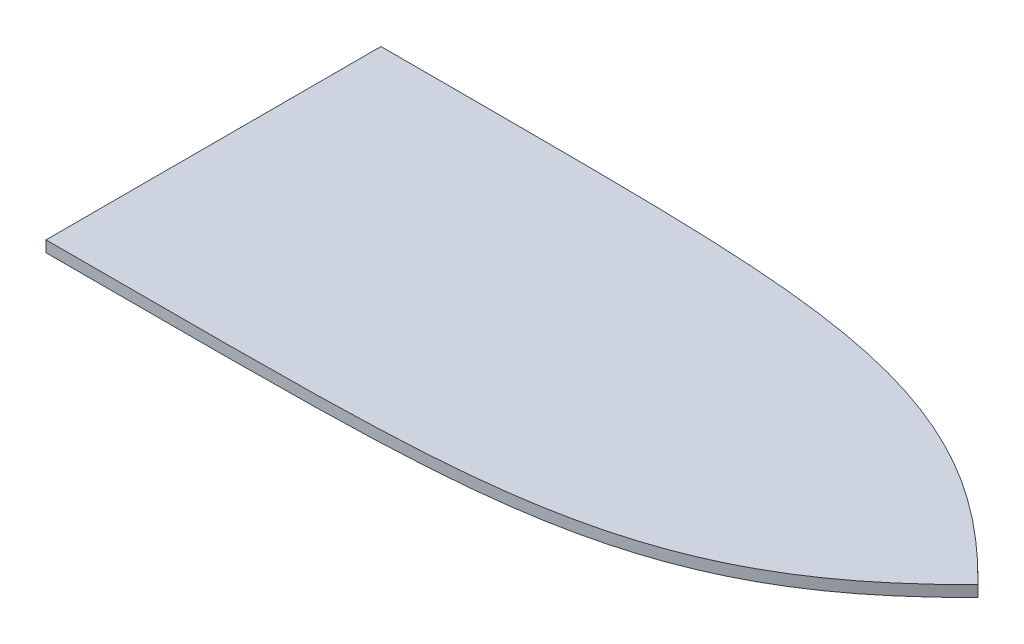
ISO-10303-21;
HEADER;
FILE_DESCRIPTION(('STEP AP214'),'2;1');
FILE_NAME('part.step','',(''),(''),'','','');
FILE_SCHEMA(('AUTOMOTIVE_DESIGN { 1 0 10303 214 1 1 1 1 }'));
ENDSEC;
DATA;
#1=APPLICATION_CONTEXT('core data for automotive mechanical design processes');
#2=APPLICATION_PROTOCOL_DEFINITION('international standard','automotive_design',2000,#1);
#3=PRODUCT_CONTEXT('',#1,'mechanical');
#4=PRODUCT('Part','Part','',(#3));
#5=PRODUCT_RELATED_PRODUCT_CATEGORY('part','',(#4));
#6=PRODUCT_DEFINITION_FORMATION('','',#4);
#7=PRODUCT_DEFINITION_CONTEXT('part definition',#1,'design');
#8=PRODUCT_DEFINITION('design','',#6,#7);
#9=PRODUCT_DEFINITION_SHAPE('','',#8);
#10=(LENGTH_UNIT() NAMED_UNIT(*) SI_UNIT(.MILLI.,.METRE.));
#11=(NAMED_UNIT(*) PLANE_ANGLE_UNIT() SI_UNIT($,.RADIAN.));
#12=(NAMED_UNIT(*) SI_UNIT($,.STERADIAN.) SOLID_ANGLE_UNIT());
#13=UNCERTAINTY_MEASURE_WITH_UNIT(LENGTH_MEASURE(1.E-05),#10,'distance_accuracy_value','');
#14=(GEOMETRIC_REPRESENTATION_CONTEXT(3) GLOBAL_UNCERTAINTY_ASSIGNED_CONTEXT((#13)) GLOBAL_UNIT_ASSIGNED_CONTEXT((#10,
#11,#12)) REPRESENTATION_CONTEXT('',''));
#15=CARTESIAN_POINT('',(0.,0.,0.));
#16=DIRECTION('',(0.,0.,1.));
#17=DIRECTION('',(1.,0.,0.));
#18=AXIS2_PLACEMENT_3D('',#15,#16,#17);
#19=CARTESIAN_POINT('',(3126.38132717579,1126.49564461762,190.290110191663));
#20=CARTESIAN_POINT('',(3145.55899842546,1126.49564461762,190.290110191663));
#21=CARTESIAN_POINT('',(3164.73667100085,1126.49564461762,190.290361376031));
#22=CARTESIAN_POINT('',(3203.0920051003,1126.49564461762,190.288769856083));
#23=CARTESIAN_POINT('',(3222.26966809878,1126.49564461762,190.28720650738));
#24=CARTESIAN_POINT('',(3260.6249139643,1126.49564461762,190.268897357972));
#25=CARTESIAN_POINT('',(3279.80249832739,1126.49564461762,190.252435010212));
#26=CARTESIAN_POINT('',(3318.15741505144,1126.49564461762,190.171763624873));
#27=CARTESIAN_POINT('',(3337.33474896159,1126.49564461762,190.107848108966));
#28=CARTESIAN_POINT('',(3375.68884457487,1126.49564461762,189.871601358953));
#29=CARTESIAN_POINT('',(3394.86560792166,1126.49564461762,189.699581549423));
#30=CARTESIAN_POINT('',(3433.21804614632,1126.49564461762,189.149310376775));
#31=CARTESIAN_POINT('',(3452.39655038311,1126.49564461762,188.771308458225));
#32=CARTESIAN_POINT('',(3490.73803525502,1126.49564461762,187.664823704028));
#33=CARTESIAN_POINT('',(3509.89746429211,1126.49564461762,186.936761405439));
#34=CARTESIAN_POINT('',(3548.18075169245,1126.49564461762,184.930982148366));
#35=CARTESIAN_POINT('',(3567.30462912808,1126.49564461762,183.65355990525));
#36=CARTESIAN_POINT('',(3595.95095268833,1126.49564461762,181.127168551783));
#37=CARTESIAN_POINT('',(3605.49311059666,1126.49564461762,180.182795126516));
#38=CARTESIAN_POINT('',(3619.79449109195,1126.49564461762,178.583024866821));
#39=CARTESIAN_POINT('',(3624.56158117287,1126.49564461762,178.018949986125));
#40=CARTESIAN_POINT('',(3634.08223039328,1126.49564461762,176.825410574507));
#41=CARTESIAN_POINT('',(3638.83302976218,1126.49564461762,176.196315819789));
#42=CARTESIAN_POINT('',(3662.53581528294,1126.49564461762,172.877050276513));
#43=CARTESIAN_POINT('',(3681.33438224533,1126.49564461762,169.666233066305));
#44=CARTESIAN_POINT('',(3718.50803120523,1126.49564461762,161.807451621774));
#45=CARTESIAN_POINT('',(3736.88278069571,1126.49564461762,157.158358984965));
#46=CARTESIAN_POINT('',(3773.11172797938,1126.49564461762,146.093619088016));
#47=CARTESIAN_POINT('',(3790.96545795827,1126.49564461762,139.676384243934));
#48=CARTESIAN_POINT('',(3817.29142422314,1126.49564461762,128.507694941196));
#49=CARTESIAN_POINT('',(3825.99110795359,1126.49564461762,124.528110667027));
#50=CARTESIAN_POINT('',(3838.92101640911,1126.49564461762,118.152799142926));
#51=CARTESIAN_POINT('',(3843.21106522886,1126.49564461762,115.96009213403));
#52=CARTESIAN_POINT('',(3849.61564966226,1126.49564461762,112.567564233644));
#53=CARTESIAN_POINT('',(3851.74737870301,1126.49564461762,111.418399334887));
#54=CARTESIAN_POINT('',(3855.9885348718,1126.49564461762,109.09196681709));
#55=CARTESIAN_POINT('',(3858.09815000584,1126.49564461762,107.914646677153));
#56=CARTESIAN_POINT('',(3868.59192520059,1126.49564461762,101.958188190843));
#57=CARTESIAN_POINT('',(3876.8129489964,1126.49564461762,96.9691743638711));
#58=CARTESIAN_POINT('',(3892.92396640865,1126.49564461762,86.5652750128258));
#59=CARTESIAN_POINT('',(3900.81396392045,1126.49564461762,81.1503945001743));
#60=CARTESIAN_POINT('',(3916.28581346307,1126.49564461762,69.9242030370405));
#61=CARTESIAN_POINT('',(3923.86765586817,1126.49564461762,64.1128797030446));
#62=CARTESIAN_POINT('',(3938.75204040131,1126.49564461762,52.1309120715934));
#63=CARTESIAN_POINT('',(3946.05455161555,1126.49564461762,45.9602280033876));
#64=CARTESIAN_POINT('',(3960.41565430139,1126.49564461762,33.3050561076343));
#65=CARTESIAN_POINT('',(3967.47418175314,1126.49564461762,26.8204859182691));
#66=CARTESIAN_POINT('',(3981.39060421351,1126.49564461762,13.5932310703164));
#67=CARTESIAN_POINT('',(3988.24838146846,1126.49564461762,6.85039492114141));
#68=CARTESIAN_POINT('',(3995.03275574722,1126.49564461762,0.0131255390144778));
#69=B_SPLINE_CURVE_WITH_KNOTS('',3,(#19,#20,#21,#22,#23,#24,#25,#26,#27,#28,#29,#30,#31,#32,#33,
#34,#35,#36,#37,#38,#39,#40,#41,#42,#43,#44,#45,#46,#47,#48,#49,#50,#51,#52,#53,#54,#55,#56,#57,
#58,#59,#60,#61,#62,#63,#64,#65,#66,#67,#68),.UNSPECIFIED.,.F.,.F.,(4,2,2,2,2,2,2,2,2,2,2,2,2,2,
2,2,2,2,2,2,2,2,2,2,4),(0.,0.0624999999999999,0.125,0.1875,0.25,0.3125,0.375,0.437499999999999,
0.499999999999999,0.531249999999999,0.546874999999999,0.562499999999999,0.625000000000001,
0.687500000000002,0.750000000000003,0.781250000000004,0.796875000000004,0.804687500000004,
0.812500000000003,0.843750000000003,0.875000000000002,0.906250000000002,0.937500000000001,
0.96875,1.),.UNSPECIFIED.);
#70=DIRECTION('',(0.,-1.,0.));
#71=VECTOR('',#70,1.);
#72=SURFACE_OF_LINEAR_EXTRUSION('',#69,#71);
#73=CARTESIAN_POINT('',(3126.38132717579,1113.79564461762,190.290110191663));
#74=CARTESIAN_POINT('',(3145.55899842546,1113.79564461762,190.290110191663));
#75=CARTESIAN_POINT('',(3164.73667100085,1113.79564461762,190.290361376031));
#76=CARTESIAN_POINT('',(3203.0920051003,1113.79564461762,190.288769856083));
#77=CARTESIAN_POINT('',(3222.26966809878,1113.79564461762,190.28720650738));
#78=CARTESIAN_POINT('',(3260.6249139643,1113.79564461762,190.268897357972));
#79=CARTESIAN_POINT('',(3279.80249832739,1113.79564461762,190.252435010212));
#80=CARTESIAN_POINT('',(3318.15741505144,1113.79564461762,190.171763624873));
#81=CARTESIAN_POINT('',(3337.33474896159,1113.79564461762,190.107848108966));
#82=CARTESIAN_POINT('',(3375.68884457487,1113.79564461762,189.871601358953));
#83=CARTESIAN_POINT('',(3394.86560792166,1113.79564461762,189.699581549423));
#84=CARTESIAN_POINT('',(3433.21804614632,1113.79564461762,189.149310376775));
#85=CARTESIAN_POINT('',(3452.39655038311,1113.79564461762,188.771308458225));
#86=CARTESIAN_POINT('',(3490.73803525502,1113.79564461762,187.664823704028));
#87=CARTESIAN_POINT('',(3509.89746429211,1113.79564461762,186.936761405439));
#88=CARTESIAN_POINT('',(3548.18075169245,1113.79564461762,184.930982148366));
#89=CARTESIAN_POINT('',(3567.30462912808,1113.79564461762,183.65355990525));
#90=CARTESIAN_POINT('',(3595.95095268833,1113.79564461762,181.127168551783));
#91=CARTESIAN_POINT('',(3605.49311059666,1113.79564461762,180.182795126516));
#92=CARTESIAN_POINT('',(3619.79449109195,1113.79564461762,178.583024866821));
#93=CARTESIAN_POINT('',(3624.56158117287,1113.79564461762,178.018949986125));
#94=CARTESIAN_POINT('',(3634.08223039328,1113.79564461762,176.825410574507));
#95=CARTESIAN_POINT('',(3638.83302976218,1113.79564461762,176.196315819789));
#96=CARTESIAN_POINT('',(3662.53581528294,1113.79564461762,172.877050276513));
#97=CARTESIAN_POINT('',(3681.33438224533,1113.79564461762,169.666233066305));
#98=CARTESIAN_POINT('',(3718.50803120523,1113.79564461762,161.807451621774));
#99=CARTESIAN_POINT('',(3736.88278069571,1113.79564461762,157.158358984965));
#100=CARTESIAN_POINT('',(3773.11172797938,1113.79564461762,146.093619088016));
#101=CARTESIAN_POINT('',(3790.96545795827,1113.79564461762,139.676384243934));
#102=CARTESIAN_POINT('',(3817.29142422314,1113.79564461762,128.507694941196));
#103=CARTESIAN_POINT('',(3825.99110795359,1113.79564461762,124.528110667027));
#104=CARTESIAN_POINT('',(3838.92101640911,1113.79564461762,118.152799142926));
#105=CARTESIAN_POINT('',(3843.21106522886,1113.79564461762,115.96009213403));
#106=CARTESIAN_POINT('',(3849.61564966226,1113.79564461762,112.567564233644));
#107=CARTESIAN_POINT('',(3851.74737870301,1113.79564461762,111.418399334887));
#108=CARTESIAN_POINT('',(3855.9885348718,1113.79564461762,109.09196681709));
#109=CARTESIAN_POINT('',(3858.09815000584,1113.79564461762,107.914646677153));
#110=CARTESIAN_POINT('',(3868.59192520059,1113.79564461762,101.958188190843));
#111=CARTESIAN_POINT('',(3876.8129489964,1113.79564461762,96.9691743638711));
#112=CARTESIAN_POINT('',(3892.92396640865,1113.79564461762,86.5652750128258));
#113=CARTESIAN_POINT('',(3900.81396392045,1113.79564461762,81.1503945001743));
#114=CARTESIAN_POINT('',(3916.28581346307,1113.79564461762,69.9242030370405));
#115=CARTESIAN_POINT('',(3923.86765586817,1113.79564461762,64.1128797030446));
#116=CARTESIAN_POINT('',(3938.75204040131,1113.79564461762,52.1309120715934));
#117=CARTESIAN_POINT('',(3946.05455161555,1113.79564461762,45.9602280033876));
#118=CARTESIAN_POINT('',(3960.41565430139,1113.79564461762,33.3050561076343));
#119=CARTESIAN_POINT('',(3967.47418175314,1113.79564461762,26.8204859182691));
#120=CARTESIAN_POINT('',(3981.39060421351,1113.79564461762,13.5932310703164));
#121=CARTESIAN_POINT('',(3988.24838146846,1113.79564461762,6.85039492114141));
#122=CARTESIAN_POINT('',(3995.03275574722,1113.79564461762,0.0131255390144778));
#123=B_SPLINE_CURVE_WITH_KNOTS('',3,(#73,#74,#75,#76,#77,#78,#79,#80,#81,#82,#83,#84,#85,#86,
#87,#88,#89,#90,#91,#92,#93,#94,#95,#96,#97,#98,#99,#100,#101,#102,#103,#104,#105,#106,#107,
#108,#109,#110,#111,#112,#113,#114,#115,#116,#117,#118,#119,#120,#121,#122),.UNSPECIFIED.,.F.,
.F.,(4,2,2,2,2,2,2,2,2,2,2,2,2,2,2,2,2,2,2,2,2,2,2,2,4),(0.,0.0624999999999999,0.125,0.1875,
0.25,0.3125,0.375,0.437499999999999,0.499999999999999,0.531249999999999,0.546874999999999,
0.562499999999999,0.625000000000001,0.687500000000002,0.750000000000003,0.781250000000004,
0.796875000000004,0.804687500000004,0.812500000000003,0.843750000000003,0.875000000000002,
0.906250000000002,0.937500000000001,0.96875,1.),.UNSPECIFIED.);
#124=CARTESIAN_POINT('',(3126.38132717579,1113.79564461762,190.290110191663));
#125=VERTEX_POINT('',#124);
#126=CARTESIAN_POINT('',(3995.03275574722,1113.79564461762,0.0131255390155955));
#127=VERTEX_POINT('',#126);
#128=EDGE_CURVE('E90',#125,#127,#123,.T.);
#129=ORIENTED_EDGE('',*,*,#128,.T.);
#130=DIRECTION('',(0.,-1.,0.));
#131=VECTOR('',#130,1.);
#132=CARTESIAN_POINT('',(3995.03275574722,1126.49564461762,0.0131255390155955));
#133=LINE('',#132,#131);
#134=CARTESIAN_POINT('',(3995.03275574722,1126.49564461762,0.0131255390155955));
#135=VERTEX_POINT('',#134);
#136=EDGE_CURVE('E11',#135,#127,#133,.T.);
#137=ORIENTED_EDGE('',*,*,#136,.F.);
#138=CARTESIAN_POINT('',(3126.38132717579,1126.49564461762,190.290110191663));
#139=VERTEX_POINT('',#138);
#140=EDGE_CURVE('E84',#139,#135,#69,.T.);
#141=ORIENTED_EDGE('',*,*,#140,.F.);
#142=DIRECTION('',(0.,-1.,0.));
#143=VECTOR('',#142,1.);
#144=CARTESIAN_POINT('',(3126.38132717579,1126.49564461762,190.290110191663));
#145=LINE('',#144,#143);
#146=EDGE_CURVE('E91',#139,#125,#145,.T.);
#147=ORIENTED_EDGE('',*,*,#146,.T.);
#148=EDGE_LOOP('',(#129,#137,#141,#147));
#149=FACE_BOUND('',#148,.T.);
#150=ADVANCED_FACE('F43',(#149),#72,.F.);
#151=CARTESIAN_POINT('',(3995.03275574722,1126.49564461762,0.0131255390155955));
#152=CARTESIAN_POINT('',(3988.27400703092,1126.49564461762,-6.79831848820773));
#153=CARTESIAN_POINT('',(3981.44491199492,1126.49564461762,-13.5134848270649));
#154=CARTESIAN_POINT('',(3967.59492702722,1126.49564461762,-26.6813223340386));
#155=CARTESIAN_POINT('',(3960.57414978155,1126.49564461762,-33.1341477269943));
#156=CARTESIAN_POINT('',(3946.30047640637,1126.49564461762,-45.7221149487883));
#157=CARTESIAN_POINT('',(3939.04764289468,1126.49564461762,-51.8573424779146));
#158=CARTESIAN_POINT('',(3924.27740565611,1126.49564461762,-63.7657002886806));
#159=CARTESIAN_POINT('',(3916.76003391145,1126.49564461762,-69.5388743419838));
#160=CARTESIAN_POINT('',(3901.43478894199,1126.49564461762,-80.6876350396419));
#161=CARTESIAN_POINT('',(3893.62692838034,1126.49564461762,-86.0632390151013));
#162=CARTESIAN_POINT('',(3877.70066460651,1126.49564461762,-96.3894307226177));
#163=CARTESIAN_POINT('',(3869.58226219495,1126.49564461762,-101.340019550417));
#164=CARTESIAN_POINT('',(3853.02058877224,1126.49564461762,-110.796574119445));
#165=CARTESIAN_POINT('',(3844.57731239192,1126.49564461762,-115.302532512274));
#166=CARTESIAN_POINT('',(3831.66235577614,1126.49564461762,-121.71925646162));
#167=CARTESIAN_POINT('',(3827.31574254016,1126.49564461762,-123.801191763108));
#168=CARTESIAN_POINT('',(3818.5387572713,1126.49564461762,-127.850428034349));
#169=CARTESIAN_POINT('',(3814.12988083734,1126.49564461762,-129.807781740319));
#170=CARTESIAN_POINT('',(3792.00361957349,1126.49564461762,-139.260601754897));
#171=CARTESIAN_POINT('',(3774.02172415076,1126.49564461762,-145.760161330034));
#172=CARTESIAN_POINT('',(3737.57904788596,1126.49564461762,-156.947481092662));
#173=CARTESIAN_POINT('',(3719.11870565644,1126.49564461762,-161.636900712472));
#174=CARTESIAN_POINT('',(3681.81162256509,1126.49564461762,-169.553852040892));
#175=CARTESIAN_POINT('',(3662.96517207717,1126.49564461762,-172.782482340553));
#176=CARTESIAN_POINT('',(3639.2218984145,1126.49564461762,-176.117550684878));
#177=CARTESIAN_POINT('',(3634.46396688847,1126.49564461762,-176.749466837517));
#178=CARTESIAN_POINT('',(3624.93087107683,1126.49564461762,-177.948101285476));
#179=CARTESIAN_POINT('',(3620.15805787969,1126.49564461762,-178.514500742744));
#180=CARTESIAN_POINT('',(3605.84017255173,1126.49564461762,-180.120755366455));
#181=CARTESIAN_POINT('',(3596.28825873017,1126.49564461762,-181.068760732339));
#182=CARTESIAN_POINT('',(3567.61581320509,1126.49564461762,-183.604560378366));
#183=CARTESIAN_POINT('',(3548.47869505607,1126.49564461762,-184.886308388053));
#184=CARTESIAN_POINT('',(3510.17459449122,1126.49564461762,-186.898761239719));
#185=CARTESIAN_POINT('',(3491.00759497538,1126.49564461762,-187.629150559353));
#186=CARTESIAN_POINT('',(3452.65458955869,1126.49564461762,-188.739231199498));
#187=CARTESIAN_POINT('',(3433.46856619936,1126.49564461762,-189.118600383608));
#188=CARTESIAN_POINT('',(3395.08533849624,1126.49564461762,-189.671031825355));
#189=CARTESIAN_POINT('',(3375.89189792763,1126.49564461762,-189.843735156357));
#190=CARTESIAN_POINT('',(3337.50614757186,1126.49564461762,-190.080902136725));
#191=CARTESIAN_POINT('',(3318.31311742218,1126.49564461762,-190.145063146832));
#192=CARTESIAN_POINT('',(3279.92692231345,1126.49564461762,-190.226043260049));
#193=CARTESIAN_POINT('',(3260.73375651452,1126.49564461762,-190.242567417765));
#194=CARTESIAN_POINT('',(3222.34738314104,1126.49564461762,-190.260945106535));
#195=CARTESIAN_POINT('',(3203.15417475588,1126.49564461762,-190.262513974624));
#196=CARTESIAN_POINT('',(3164.76775359893,1126.49564461762,-190.264111226616));
#197=CARTESIAN_POINT('',(3145.57454002841,1126.49564461762,-190.263859113631));
#198=CARTESIAN_POINT('',(3126.38132717579,1126.49564461762,-190.263859113631));
#199=B_SPLINE_CURVE_WITH_KNOTS('',3,(#151,#152,#153,#154,#155,#156,#157,#158,#159,#160,#161,
#162,#163,#164,#165,#166,#167,#168,#169,#170,#171,#172,#173,#174,#175,#176,#177,#178,#179,#180,
#181,#182,#183,#184,#185,#186,#187,#188,#189,#190,#191,#192,#193,#194,#195,#196,#197,#198),
.UNSPECIFIED.,.F.,.F.,(4,2,2,2,2,2,2,2,2,2,2,2,2,2,2,2,2,2,2,2,2,2,2,4),(0.,0.0312500000000013,
0.0625000000000025,0.0937500000000038,0.125000000000005,0.156250000000006,0.187500000000008,
0.218750000000009,0.234375000000009,0.250000000000009,0.31250000000001,0.375000000000011,
0.437500000000012,0.453125000000013,0.468750000000014,0.500000000000014,0.562500000000012,
0.62500000000001,0.687500000000009,0.750000000000007,0.812500000000005,0.875000000000004,
0.937500000000002,1.),.UNSPECIFIED.);
#200=DIRECTION('',(0.,-1.,0.));
#201=VECTOR('',#200,1.);
#202=SURFACE_OF_LINEAR_EXTRUSION('',#199,#201);
#203=CARTESIAN_POINT('',(3995.03275574722,1113.79564461762,0.0131255390155955));
#204=CARTESIAN_POINT('',(3988.27400703092,1113.79564461762,-6.79831848820773));
#205=CARTESIAN_POINT('',(3981.44491199492,1113.79564461762,-13.5134848270649));
#206=CARTESIAN_POINT('',(3967.59492702722,1113.79564461762,-26.6813223340386));
#207=CARTESIAN_POINT('',(3960.57414978155,1113.79564461762,-33.1341477269943));
#208=CARTESIAN_POINT('',(3946.30047640637,1113.79564461762,-45.7221149487883));
#209=CARTESIAN_POINT('',(3939.04764289468,1113.79564461762,-51.8573424779146));
#210=CARTESIAN_POINT('',(3924.27740565611,1113.79564461762,-63.7657002886806));
#211=CARTESIAN_POINT('',(3916.76003391145,1113.79564461762,-69.5388743419838));
#212=CARTESIAN_POINT('',(3901.43478894199,1113.79564461762,-80.6876350396419));
#213=CARTESIAN_POINT('',(3893.62692838034,1113.79564461762,-86.0632390151013));
#214=CARTESIAN_POINT('',(3877.70066460651,1113.79564461762,-96.3894307226177));
#215=CARTESIAN_POINT('',(3869.58226219495,1113.79564461762,-101.340019550417));
#216=CARTESIAN_POINT('',(3853.02058877224,1113.79564461762,-110.796574119445));
#217=CARTESIAN_POINT('',(3844.57731239192,1113.79564461762,-115.302532512274));
#218=CARTESIAN_POINT('',(3831.66235577614,1113.79564461762,-121.71925646162));
#219=CARTESIAN_POINT('',(3827.31574254016,1113.79564461762,-123.801191763108));
#220=CARTESIAN_POINT('',(3818.5387572713,1113.79564461762,-127.850428034349));
#221=CARTESIAN_POINT('',(3814.12988083734,1113.79564461762,-129.807781740319));
#222=CARTESIAN_POINT('',(3792.00361957349,1113.79564461762,-139.260601754897));
#223=CARTESIAN_POINT('',(3774.02172415076,1113.79564461762,-145.760161330034));
#224=CARTESIAN_POINT('',(3737.57904788596,1113.79564461762,-156.947481092662));
#225=CARTESIAN_POINT('',(3719.11870565644,1113.79564461762,-161.636900712472));
#226=CARTESIAN_POINT('',(3681.81162256509,1113.79564461762,-169.553852040892));
#227=CARTESIAN_POINT('',(3662.96517207717,1113.79564461762,-172.782482340553));
#228=CARTESIAN_POINT('',(3639.2218984145,1113.79564461762,-176.117550684878));
#229=CARTESIAN_POINT('',(3634.46396688847,1113.79564461762,-176.749466837517));
#230=CARTESIAN_POINT('',(3624.93087107683,1113.79564461762,-177.948101285476));
#231=CARTESIAN_POINT('',(3620.15805787969,1113.79564461762,-178.514500742744));
#232=CARTESIAN_POINT('',(3605.84017255173,1113.79564461762,-180.120755366455));
#233=CARTESIAN_POINT('',(3596.28825873017,1113.79564461762,-181.068760732339));
#234=CARTESIAN_POINT('',(3567.61581320509,1113.79564461762,-183.604560378366));
#235=CARTESIAN_POINT('',(3548.47869505607,1113.79564461762,-184.886308388053));
#236=CARTESIAN_POINT('',(3510.17459449122,1113.79564461762,-186.898761239719));
#237=CARTESIAN_POINT('',(3491.00759497538,1113.79564461762,-187.629150559353));
#238=CARTESIAN_POINT('',(3452.65458955869,1113.79564461762,-188.739231199498));
#239=CARTESIAN_POINT('',(3433.46856619936,1113.79564461762,-189.118600383608));
#240=CARTESIAN_POINT('',(3395.08533849624,1113.79564461762,-189.671031825355));
#241=CARTESIAN_POINT('',(3375.89189792763,1113.79564461762,-189.843735156357));
#242=CARTESIAN_POINT('',(3337.50614757186,1113.79564461762,-190.080902136725));
#243=CARTESIAN_POINT('',(3318.31311742218,1113.79564461762,-190.145063146832));
#244=CARTESIAN_POINT('',(3279.92692231345,1113.79564461762,-190.226043260049));
#245=CARTESIAN_POINT('',(3260.73375651452,1113.79564461762,-190.242567417765));
#246=CARTESIAN_POINT('',(3222.34738314104,1113.79564461762,-190.260945106535));
#247=CARTESIAN_POINT('',(3203.15417475588,1113.79564461762,-190.262513974624));
#248=CARTESIAN_POINT('',(3164.76775359893,1113.79564461762,-190.264111226616));
#249=CARTESIAN_POINT('',(3145.57454002841,1113.79564461762,-190.263859113631));
#250=CARTESIAN_POINT('',(3126.38132717579,1113.79564461762,-190.263859113631));
#251=B_SPLINE_CURVE_WITH_KNOTS('',3,(#203,#204,#205,#206,#207,#208,#209,#210,#211,#212,#213,
#214,#215,#216,#217,#218,#219,#220,#221,#222,#223,#224,#225,#226,#227,#228,#229,#230,#231,#232,
#233,#234,#235,#236,#237,#238,#239,#240,#241,#242,#243,#244,#245,#246,#247,#248,#249,#250),
.UNSPECIFIED.,.F.,.F.,(4,2,2,2,2,2,2,2,2,2,2,2,2,2,2,2,2,2,2,2,2,2,2,4),(0.,0.0312500000000013,
0.0625000000000025,0.0937500000000038,0.125000000000005,0.156250000000006,0.187500000000008,
0.218750000000009,0.234375000000009,0.250000000000009,0.31250000000001,0.375000000000011,
0.437500000000012,0.453125000000013,0.468750000000014,0.500000000000014,0.562500000000012,
0.62500000000001,0.687500000000009,0.750000000000007,0.812500000000005,0.875000000000004,
0.937500000000002,1.),.UNSPECIFIED.);
#252=CARTESIAN_POINT('',(3126.38132717579,1113.79564461762,-190.263859113631));
#253=VERTEX_POINT('',#252);
#254=EDGE_CURVE('E72',#127,#253,#251,.T.);
#255=ORIENTED_EDGE('',*,*,#254,.T.);
#256=DIRECTION('',(0.,-1.,0.));
#257=VECTOR('',#256,1.);
#258=CARTESIAN_POINT('',(3126.38132717579,1126.49564461762,-190.263859113631));
#259=LINE('',#258,#257);
#260=CARTESIAN_POINT('',(3126.38132717579,1126.49564461762,-190.263859113631));
#261=VERTEX_POINT('',#260);
#262=EDGE_CURVE('E52',#261,#253,#259,.T.);
#263=ORIENTED_EDGE('',*,*,#262,.F.);
#264=EDGE_CURVE('E80',#135,#261,#199,.T.);
#265=ORIENTED_EDGE('',*,*,#264,.F.);
#266=ORIENTED_EDGE('',*,*,#136,.T.);
#267=EDGE_LOOP('',(#255,#263,#265,#266));
#268=FACE_BOUND('',#267,.T.);
#269=ADVANCED_FACE('F81',(#268),#202,.F.);
#270=CARTESIAN_POINT('',(3126.38132717579,1126.49564461762,-205.820223657062));
#271=DIRECTION('',(1.,0.,0.));
#272=DIRECTION('',(0.,0.,-1.));
#273=AXIS2_PLACEMENT_3D('',#270,#271,#272);
#274=PLANE('',#273);
#275=DIRECTION('',(0.,0.,1.));
#276=VECTOR('',#275,1.);
#277=CARTESIAN_POINT('',(3126.38132717579,1113.79564461762,-205.820223657062));
#278=LINE('',#277,#276);
#279=EDGE_CURVE('E77',#253,#125,#278,.T.);
#280=ORIENTED_EDGE('',*,*,#279,.T.);
#281=ORIENTED_EDGE('',*,*,#146,.F.);
#282=DIRECTION('',(0.,0.,1.));
#283=VECTOR('',#282,1.);
#284=CARTESIAN_POINT('',(3126.38132717579,1126.49564461762,-205.820223657062));
#285=LINE('',#284,#283);
#286=EDGE_CURVE('E60',#261,#139,#285,.T.);
#287=ORIENTED_EDGE('',*,*,#286,.F.);
#288=ORIENTED_EDGE('',*,*,#262,.T.);
#289=EDGE_LOOP('',(#280,#281,#287,#288));
#290=FACE_BOUND('',#289,.T.);
#291=ADVANCED_FACE('F108',(#290),#274,.F.);
#292=CARTESIAN_POINT('',(3586.40217816825,1126.49564461762,181.969299002938));
#293=DIRECTION('',(0.,1.,0.));
#294=DIRECTION('',(0.,0.,1.));
#295=AXIS2_PLACEMENT_3D('',#292,#293,#294);
#296=PLANE('',#295);
#297=ORIENTED_EDGE('',*,*,#140,.T.);
#298=ORIENTED_EDGE('',*,*,#264,.T.);
#299=ORIENTED_EDGE('',*,*,#286,.T.);
#300=EDGE_LOOP('',(#297,#298,#299));
#301=FACE_BOUND('',#300,.T.);
#302=ADVANCED_FACE('F87',(#301),#296,.T.);
#303=CARTESIAN_POINT('',(3586.40217816825,1113.79564461762,181.969299002938));
#304=DIRECTION('',(0.,1.,0.));
#305=DIRECTION('',(0.,0.,1.));
#306=AXIS2_PLACEMENT_3D('',#303,#304,#305);
#307=PLANE('',#306);
#308=ORIENTED_EDGE('',*,*,#128,.F.);
#309=ORIENTED_EDGE('',*,*,#279,.F.);
#310=ORIENTED_EDGE('',*,*,#254,.F.);
#311=EDGE_LOOP('',(#308,#309,#310));
#312=FACE_BOUND('',#311,.T.);
#313=ADVANCED_FACE('F109',(#312),#307,.F.);
#314=CLOSED_SHELL('',(#150,#269,#291,#302,#313));
#315=MANIFOLD_SOLID_BREP('B2',#314);
#316=ADVANCED_BREP_SHAPE_REPRESENTATION('',(#18,#315),#14);
#317=SHAPE_DEFINITION_REPRESENTATION(#9,#316);
ENDSEC;
END-ISO-10303-21;
